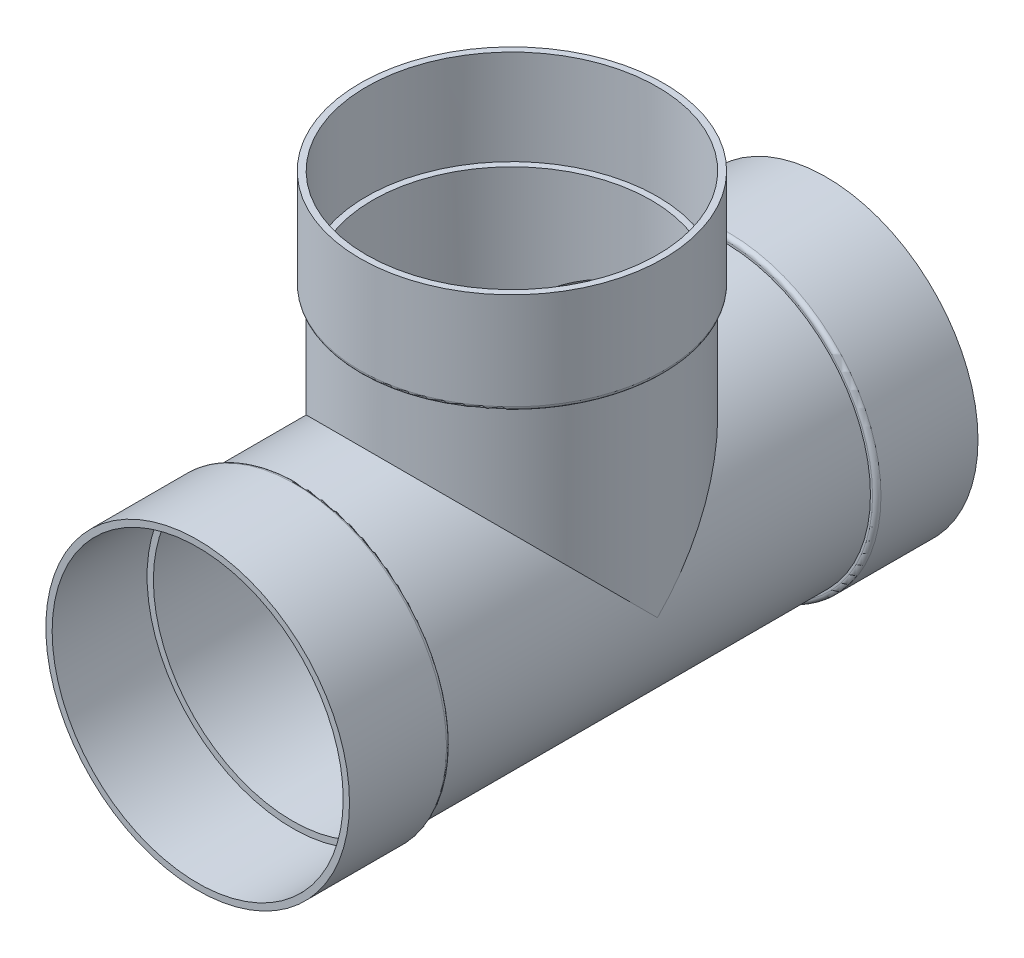
ISO-10303-21;
HEADER;
FILE_DESCRIPTION(('STEP AP214'),'2;1');
FILE_NAME('part.step','',(''),(''),'','','');
FILE_SCHEMA(('AUTOMOTIVE_DESIGN { 1 0 10303 214 1 1 1 1 }'));
ENDSEC;
DATA;
#1=APPLICATION_CONTEXT('core data for automotive mechanical design processes');
#2=APPLICATION_PROTOCOL_DEFINITION('international standard','automotive_design',2000,#1);
#3=PRODUCT_CONTEXT('',#1,'mechanical');
#4=PRODUCT('Part','Part','',(#3));
#5=PRODUCT_RELATED_PRODUCT_CATEGORY('part','',(#4));
#6=PRODUCT_DEFINITION_FORMATION('','',#4);
#7=PRODUCT_DEFINITION_CONTEXT('part definition',#1,'design');
#8=PRODUCT_DEFINITION('design','',#6,#7);
#9=PRODUCT_DEFINITION_SHAPE('','',#8);
#10=(LENGTH_UNIT() NAMED_UNIT(*) SI_UNIT(.MILLI.,.METRE.));
#11=(NAMED_UNIT(*) PLANE_ANGLE_UNIT() SI_UNIT($,.RADIAN.));
#12=(NAMED_UNIT(*) SI_UNIT($,.STERADIAN.) SOLID_ANGLE_UNIT());
#13=UNCERTAINTY_MEASURE_WITH_UNIT(LENGTH_MEASURE(1.E-05),#10,'distance_accuracy_value','');
#14=(GEOMETRIC_REPRESENTATION_CONTEXT(3) GLOBAL_UNCERTAINTY_ASSIGNED_CONTEXT((#13)) GLOBAL_UNIT_ASSIGNED_CONTEXT((#10,
#11,#12)) REPRESENTATION_CONTEXT('',''));
#15=CARTESIAN_POINT('',(0.,0.,0.));
#16=DIRECTION('',(0.,0.,1.));
#17=DIRECTION('',(1.,0.,0.));
#18=AXIS2_PLACEMENT_3D('',#15,#16,#17);
#19=CARTESIAN_POINT('',(0.,0.,236.5375));
#20=DIRECTION('',(0.,0.,-1.));
#21=DIRECTION('',(-1.,0.,0.));
#22=AXIS2_PLACEMENT_3D('',#19,#20,#21);
#23=PLANE('',#22);
#24=CARTESIAN_POINT('',(0.,0.,236.5375));
#25=DIRECTION('',(0.,0.,-1.));
#26=DIRECTION('',(-1.,0.,0.));
#27=AXIS2_PLACEMENT_3D('',#24,#25,#26);
#28=CIRCLE('',#27,109.5375);
#29=CARTESIAN_POINT('',(-109.5375,0.,236.5375));
#30=VERTEX_POINT('',#29);
#31=EDGE_CURVE('E86',#30,#30,#28,.F.);
#32=ORIENTED_EDGE('',*,*,#31,.F.);
#33=EDGE_LOOP('',(#32));
#34=FACE_BOUND('',#33,.T.);
#35=CARTESIAN_POINT('',(0.,0.,236.5375));
#36=DIRECTION('',(0.,0.,1.));
#37=DIRECTION('',(1.,0.,0.));
#38=AXIS2_PLACEMENT_3D('',#35,#36,#37);
#39=CIRCLE('',#38,114.2873);
#40=CARTESIAN_POINT('',(114.2873,0.,236.5375));
#41=VERTEX_POINT('',#40);
#42=EDGE_CURVE('E143',#41,#41,#39,.T.);
#43=ORIENTED_EDGE('',*,*,#42,.T.);
#44=EDGE_LOOP('',(#43));
#45=FACE_BOUND('',#44,.T.);
#46=ADVANCED_FACE('F53',(#34,#45),#23,.F.);
#47=CARTESIAN_POINT('',(0.,0.,168.70511138535));
#48=DIRECTION('',(0.,0.,1.));
#49=DIRECTION('',(1.,0.,0.));
#50=AXIS2_PLACEMENT_3D('',#47,#48,#49);
#51=CYLINDRICAL_SURFACE('',#50,114.2873);
#52=CARTESIAN_POINT('',(0.,0.,163.5125));
#53=DIRECTION('',(0.,0.,1.));
#54=DIRECTION('',(1.,0.,0.));
#55=AXIS2_PLACEMENT_3D('',#52,#53,#54);
#56=CIRCLE('',#55,114.2873);
#57=CARTESIAN_POINT('',(114.2873,0.,163.5125));
#58=VERTEX_POINT('',#57);
#59=EDGE_CURVE('E159',#58,#58,#56,.T.);
#60=ORIENTED_EDGE('',*,*,#59,.T.);
#61=EDGE_LOOP('',(#60));
#62=FACE_BOUND('',#61,.T.);
#63=ORIENTED_EDGE('',*,*,#42,.F.);
#64=EDGE_LOOP('',(#63));
#65=FACE_BOUND('',#64,.T.);
#66=ADVANCED_FACE('F184',(#62,#65),#51,.T.);
#67=CARTESIAN_POINT('',(0.,114.2873,160.3375));
#68=DIRECTION('',(0.,0.,1.));
#69=DIRECTION('',(1.,0.,0.));
#70=AXIS2_PLACEMENT_3D('',#67,#68,#69);
#71=PLANE('',#70);
#72=CARTESIAN_POINT('',(0.,0.,160.3375));
#73=DIRECTION('',(0.,0.,1.));
#74=DIRECTION('',(1.,0.,0.));
#75=AXIS2_PLACEMENT_3D('',#72,#73,#74);
#76=CIRCLE('',#75,111.1123);
#77=CARTESIAN_POINT('',(111.1123,0.,160.3375));
#78=VERTEX_POINT('',#77);
#79=EDGE_CURVE('E163',#78,#78,#76,.F.);
#80=ORIENTED_EDGE('',*,*,#79,.T.);
#81=EDGE_LOOP('',(#80));
#82=FACE_BOUND('',#81,.T.);
#83=CARTESIAN_POINT('',(0.,0.,160.3375));
#84=DIRECTION('',(0.,0.,1.));
#85=DIRECTION('',(1.,0.,0.));
#86=AXIS2_PLACEMENT_3D('',#83,#84,#85);
#87=CIRCLE('',#86,109.5375);
#88=CARTESIAN_POINT('',(109.5375,0.,160.3375));
#89=VERTEX_POINT('',#88);
#90=EDGE_CURVE('E139',#89,#89,#87,.T.);
#91=ORIENTED_EDGE('',*,*,#90,.T.);
#92=EDGE_LOOP('',(#91));
#93=FACE_BOUND('',#92,.T.);
#94=ADVANCED_FACE('F190',(#82,#93),#71,.F.);
#95=CARTESIAN_POINT('',(0.,0.,168.70511138535));
#96=DIRECTION('',(0.,0.,1.));
#97=DIRECTION('',(1.,0.,0.));
#98=AXIS2_PLACEMENT_3D('',#95,#96,#97);
#99=CYLINDRICAL_SURFACE('',#98,109.5375);
#100=CARTESIAN_POINT('',(0.,0.,0.));
#101=DIRECTION('',(0.,-0.707106781186547,0.707106781186547));
#102=DIRECTION('',(0.,0.707106781186547,0.707106781186547));
#103=AXIS2_PLACEMENT_3D('',#100,#101,#102);
#104=ELLIPSE('',#103,154.909418088443,109.5375);
#105=CARTESIAN_POINT('',(109.5375,0.,0.));
#106=VERTEX_POINT('',#105);
#107=CARTESIAN_POINT('',(-109.5375,0.,0.));
#108=VERTEX_POINT('',#107);
#109=EDGE_CURVE('E71',#106,#108,#104,.T.);
#110=ORIENTED_EDGE('',*,*,#109,.T.);
#111=CARTESIAN_POINT('',(0.,0.,0.));
#112=DIRECTION('',(0.,0.707106781186547,0.707106781186547));
#113=DIRECTION('',(0.,-0.707106781186547,0.707106781186547));
#114=AXIS2_PLACEMENT_3D('',#111,#112,#113);
#115=ELLIPSE('',#114,154.909418088443,109.5375);
#116=EDGE_CURVE('E68',#108,#106,#115,.F.);
#117=ORIENTED_EDGE('',*,*,#116,.T.);
#118=EDGE_LOOP('',(#110,#117));
#119=FACE_BOUND('',#118,.T.);
#120=ORIENTED_EDGE('',*,*,#90,.F.);
#121=EDGE_LOOP('',(#120));
#122=FACE_BOUND('',#121,.T.);
#123=CARTESIAN_POINT('',(0.,0.,-160.3375));
#124=DIRECTION('',(0.,0.,1.));
#125=DIRECTION('',(1.,0.,0.));
#126=AXIS2_PLACEMENT_3D('',#123,#124,#125);
#127=CIRCLE('',#126,109.5375);
#128=CARTESIAN_POINT('',(109.5375,0.,-160.3375));
#129=VERTEX_POINT('',#128);
#130=EDGE_CURVE('E135',#129,#129,#127,.T.);
#131=ORIENTED_EDGE('',*,*,#130,.T.);
#132=EDGE_LOOP('',(#131));
#133=FACE_BOUND('',#132,.T.);
#134=ADVANCED_FACE('F214',(#119,#122,#133),#99,.T.);
#135=CARTESIAN_POINT('',(0.,114.2873,-160.3375));
#136=DIRECTION('',(0.,0.,-1.));
#137=DIRECTION('',(-1.,0.,0.));
#138=AXIS2_PLACEMENT_3D('',#135,#136,#137);
#139=PLANE('',#138);
#140=CARTESIAN_POINT('',(0.,0.,-160.3375));
#141=DIRECTION('',(0.,0.,-1.));
#142=DIRECTION('',(-1.,0.,0.));
#143=AXIS2_PLACEMENT_3D('',#140,#141,#142);
#144=CIRCLE('',#143,111.1123);
#145=CARTESIAN_POINT('',(-111.1123,0.,-160.3375));
#146=VERTEX_POINT('',#145);
#147=EDGE_CURVE('E151',#146,#146,#144,.F.);
#148=ORIENTED_EDGE('',*,*,#147,.T.);
#149=EDGE_LOOP('',(#148));
#150=FACE_BOUND('',#149,.T.);
#151=ORIENTED_EDGE('',*,*,#130,.F.);
#152=EDGE_LOOP('',(#151));
#153=FACE_BOUND('',#152,.T.);
#154=ADVANCED_FACE('F210',(#150,#153),#139,.F.);
#155=CARTESIAN_POINT('',(0.,0.,168.70511138535));
#156=DIRECTION('',(0.,0.,1.));
#157=DIRECTION('',(1.,0.,0.));
#158=AXIS2_PLACEMENT_3D('',#155,#156,#157);
#159=CYLINDRICAL_SURFACE('',#158,114.2873);
#160=CARTESIAN_POINT('',(0.,0.,-163.5125));
#161=DIRECTION('',(0.,0.,-1.));
#162=DIRECTION('',(-1.,0.,0.));
#163=AXIS2_PLACEMENT_3D('',#160,#161,#162);
#164=CIRCLE('',#163,114.2873);
#165=CARTESIAN_POINT('',(-114.2873,0.,-163.5125));
#166=VERTEX_POINT('',#165);
#167=EDGE_CURVE('E155',#166,#166,#164,.T.);
#168=ORIENTED_EDGE('',*,*,#167,.T.);
#169=EDGE_LOOP('',(#168));
#170=FACE_BOUND('',#169,.T.);
#171=CARTESIAN_POINT('',(0.,0.,-236.5375));
#172=DIRECTION('',(0.,0.,1.));
#173=DIRECTION('',(1.,0.,0.));
#174=AXIS2_PLACEMENT_3D('',#171,#172,#173);
#175=CIRCLE('',#174,114.2873);
#176=CARTESIAN_POINT('',(114.2873,0.,-236.5375));
#177=VERTEX_POINT('',#176);
#178=EDGE_CURVE('E131',#177,#177,#175,.T.);
#179=ORIENTED_EDGE('',*,*,#178,.T.);
#180=EDGE_LOOP('',(#179));
#181=FACE_BOUND('',#180,.T.);
#182=ADVANCED_FACE('F213',(#170,#181),#159,.T.);
#183=CARTESIAN_POINT('',(0.,114.2873,-236.5375));
#184=DIRECTION('',(0.,0.,1.));
#185=DIRECTION('',(1.,0.,0.));
#186=AXIS2_PLACEMENT_3D('',#183,#184,#185);
#187=PLANE('',#186);
#188=CARTESIAN_POINT('',(0.,0.,-236.5375));
#189=DIRECTION('',(0.,0.,1.));
#190=DIRECTION('',(1.,0.,0.));
#191=AXIS2_PLACEMENT_3D('',#188,#189,#190);
#192=CIRCLE('',#191,109.5375);
#193=CARTESIAN_POINT('',(109.5375,0.,-236.5375));
#194=VERTEX_POINT('',#193);
#195=EDGE_CURVE('E108',#194,#194,#192,.T.);
#196=ORIENTED_EDGE('',*,*,#195,.T.);
#197=EDGE_LOOP('',(#196));
#198=FACE_BOUND('',#197,.T.);
#199=ORIENTED_EDGE('',*,*,#178,.F.);
#200=EDGE_LOOP('',(#199));
#201=FACE_BOUND('',#200,.T.);
#202=ADVANCED_FACE('F229',(#198,#201),#187,.F.);
#203=CARTESIAN_POINT('',(0.,0.,0.));
#204=DIRECTION('',(0.,1.,0.));
#205=DIRECTION('',(0.,0.,1.));
#206=AXIS2_PLACEMENT_3D('',#203,#204,#205);
#207=CYLINDRICAL_SURFACE('',#206,109.5375);
#208=CARTESIAN_POINT('',(0.,160.3375,0.));
#209=DIRECTION('',(0.,1.,0.));
#210=DIRECTION('',(0.,0.,1.));
#211=AXIS2_PLACEMENT_3D('',#208,#209,#210);
#212=CIRCLE('',#211,109.5375);
#213=CARTESIAN_POINT('',(0.,160.3375,109.5375));
#214=VERTEX_POINT('',#213);
#215=EDGE_CURVE('E90',#214,#214,#212,.T.);
#216=ORIENTED_EDGE('',*,*,#215,.F.);
#217=EDGE_LOOP('',(#216));
#218=FACE_BOUND('',#217,.T.);
#219=ORIENTED_EDGE('',*,*,#116,.F.);
#220=ORIENTED_EDGE('',*,*,#109,.F.);
#221=EDGE_LOOP('',(#219,#220));
#222=FACE_BOUND('',#221,.T.);
#223=ADVANCED_FACE('F233',(#218,#222),#207,.T.);
#224=CARTESIAN_POINT('',(0.,236.5375,0.));
#225=DIRECTION('',(0.,1.,0.));
#226=DIRECTION('',(0.,0.,1.));
#227=AXIS2_PLACEMENT_3D('',#224,#225,#226);
#228=PLANE('',#227);
#229=CARTESIAN_POINT('',(0.,236.5375,0.));
#230=DIRECTION('',(0.,1.,0.));
#231=DIRECTION('',(0.,0.,1.));
#232=AXIS2_PLACEMENT_3D('',#229,#230,#231);
#233=CIRCLE('',#232,109.5375);
#234=CARTESIAN_POINT('',(0.,236.5375,109.5375));
#235=VERTEX_POINT('',#234);
#236=EDGE_CURVE('E117',#235,#235,#233,.T.);
#237=ORIENTED_EDGE('',*,*,#236,.F.);
#238=EDGE_LOOP('',(#237));
#239=FACE_BOUND('',#238,.T.);
#240=CARTESIAN_POINT('',(0.,236.5375,0.));
#241=DIRECTION('',(0.,1.,0.));
#242=DIRECTION('',(0.,0.,1.));
#243=AXIS2_PLACEMENT_3D('',#240,#241,#242);
#244=CIRCLE('',#243,114.2873);
#245=CARTESIAN_POINT('',(0.,236.5375,114.2873));
#246=VERTEX_POINT('',#245);
#247=EDGE_CURVE('E95',#246,#246,#244,.T.);
#248=ORIENTED_EDGE('',*,*,#247,.T.);
#249=EDGE_LOOP('',(#248));
#250=FACE_BOUND('',#249,.T.);
#251=ADVANCED_FACE('F235',(#239,#250),#228,.T.);
#252=CARTESIAN_POINT('',(0.,0.,0.));
#253=DIRECTION('',(0.,1.,0.));
#254=DIRECTION('',(0.,0.,1.));
#255=AXIS2_PLACEMENT_3D('',#252,#253,#254);
#256=CYLINDRICAL_SURFACE('',#255,114.2873);
#257=CARTESIAN_POINT('',(0.,163.5125,0.));
#258=DIRECTION('',(0.,-1.,0.));
#259=DIRECTION('',(0.,0.,-1.));
#260=AXIS2_PLACEMENT_3D('',#257,#258,#259);
#261=CIRCLE('',#260,114.2873);
#262=CARTESIAN_POINT('',(0.,163.5125,-114.2873));
#263=VERTEX_POINT('',#262);
#264=EDGE_CURVE('E62',#263,#263,#261,.F.);
#265=ORIENTED_EDGE('',*,*,#264,.T.);
#266=EDGE_LOOP('',(#265));
#267=FACE_BOUND('',#266,.T.);
#268=ORIENTED_EDGE('',*,*,#247,.F.);
#269=EDGE_LOOP('',(#268));
#270=FACE_BOUND('',#269,.T.);
#271=ADVANCED_FACE('F171',(#267,#270),#256,.T.);
#272=CARTESIAN_POINT('',(0.,160.3375,114.2873));
#273=DIRECTION('',(0.,-1.,0.));
#274=DIRECTION('',(0.,0.,-1.));
#275=AXIS2_PLACEMENT_3D('',#272,#273,#274);
#276=PLANE('',#275);
#277=CARTESIAN_POINT('',(0.,160.3375,0.));
#278=DIRECTION('',(0.,-1.,0.));
#279=DIRECTION('',(0.,0.,-1.));
#280=AXIS2_PLACEMENT_3D('',#277,#278,#279);
#281=CIRCLE('',#280,111.1123);
#282=CARTESIAN_POINT('',(0.,160.3375,-111.1123));
#283=VERTEX_POINT('',#282);
#284=EDGE_CURVE('E13',#283,#283,#281,.T.);
#285=ORIENTED_EDGE('',*,*,#284,.T.);
#286=EDGE_LOOP('',(#285));
#287=FACE_BOUND('',#286,.T.);
#288=ORIENTED_EDGE('',*,*,#215,.T.);
#289=EDGE_LOOP('',(#288));
#290=FACE_BOUND('',#289,.T.);
#291=ADVANCED_FACE('F241',(#287,#290),#276,.T.);
#292=CARTESIAN_POINT('',(0.,0.,168.70511138535));
#293=DIRECTION('',(0.,0.,1.));
#294=DIRECTION('',(1.,0.,0.));
#295=AXIS2_PLACEMENT_3D('',#292,#293,#294);
#296=CYLINDRICAL_SURFACE('',#295,109.5375);
#297=ORIENTED_EDGE('',*,*,#31,.T.);
#298=EDGE_LOOP('',(#297));
#299=FACE_BOUND('',#298,.T.);
#300=CARTESIAN_POINT('',(0.,0.,165.0873));
#301=DIRECTION('',(0.,0.,1.));
#302=DIRECTION('',(1.,0.,0.));
#303=AXIS2_PLACEMENT_3D('',#300,#301,#302);
#304=CIRCLE('',#303,109.5375);
#305=CARTESIAN_POINT('',(109.5375,0.,165.0873));
#306=VERTEX_POINT('',#305);
#307=EDGE_CURVE('E121',#306,#306,#304,.T.);
#308=ORIENTED_EDGE('',*,*,#307,.F.);
#309=EDGE_LOOP('',(#308));
#310=FACE_BOUND('',#309,.T.);
#311=ADVANCED_FACE('F244',(#299,#310),#296,.F.);
#312=CARTESIAN_POINT('',(0.,114.2873,165.0873));
#313=DIRECTION('',(0.,0.,1.));
#314=DIRECTION('',(1.,0.,0.));
#315=AXIS2_PLACEMENT_3D('',#312,#313,#314);
#316=PLANE('',#315);
#317=ORIENTED_EDGE('',*,*,#307,.T.);
#318=EDGE_LOOP('',(#317));
#319=FACE_BOUND('',#318,.T.);
#320=CARTESIAN_POINT('',(0.,0.,165.0873));
#321=DIRECTION('',(0.,0.,1.));
#322=DIRECTION('',(1.,0.,0.));
#323=AXIS2_PLACEMENT_3D('',#320,#321,#322);
#324=CIRCLE('',#323,104.7877);
#325=CARTESIAN_POINT('',(104.7877,0.,165.0873));
#326=VERTEX_POINT('',#325);
#327=EDGE_CURVE('E103',#326,#326,#324,.T.);
#328=ORIENTED_EDGE('',*,*,#327,.F.);
#329=EDGE_LOOP('',(#328));
#330=FACE_BOUND('',#329,.T.);
#331=ADVANCED_FACE('F265',(#319,#330),#316,.T.);
#332=CARTESIAN_POINT('',(0.,0.,168.70511138535));
#333=DIRECTION('',(0.,0.,1.));
#334=DIRECTION('',(1.,0.,0.));
#335=AXIS2_PLACEMENT_3D('',#332,#333,#334);
#336=CYLINDRICAL_SURFACE('',#335,104.7877);
#337=CARTESIAN_POINT('',(0.,0.,0.));
#338=DIRECTION('',(0.,-0.707106781186547,0.707106781186547));
#339=DIRECTION('',(0.,0.707106781186547,0.707106781186547));
#340=AXIS2_PLACEMENT_3D('',#337,#338,#339);
#341=ELLIPSE('',#340,148.192186509883,104.7877);
#342=CARTESIAN_POINT('',(104.7877,0.,0.));
#343=VERTEX_POINT('',#342);
#344=CARTESIAN_POINT('',(-104.7877,0.,0.));
#345=VERTEX_POINT('',#344);
#346=EDGE_CURVE('E79',#343,#345,#341,.T.);
#347=ORIENTED_EDGE('',*,*,#346,.F.);
#348=CARTESIAN_POINT('',(0.,0.,0.));
#349=DIRECTION('',(0.,0.707106781186547,0.707106781186547));
#350=DIRECTION('',(0.,-0.707106781186547,0.707106781186547));
#351=AXIS2_PLACEMENT_3D('',#348,#349,#350);
#352=ELLIPSE('',#351,148.192186509883,104.7877);
#353=EDGE_CURVE('E83',#345,#343,#352,.F.);
#354=ORIENTED_EDGE('',*,*,#353,.F.);
#355=EDGE_LOOP('',(#347,#354));
#356=FACE_BOUND('',#355,.T.);
#357=ORIENTED_EDGE('',*,*,#327,.T.);
#358=EDGE_LOOP('',(#357));
#359=FACE_BOUND('',#358,.T.);
#360=CARTESIAN_POINT('',(0.,0.,-165.0873));
#361=DIRECTION('',(0.,0.,-1.));
#362=DIRECTION('',(-1.,0.,0.));
#363=AXIS2_PLACEMENT_3D('',#360,#361,#362);
#364=CIRCLE('',#363,104.7877);
#365=CARTESIAN_POINT('',(-104.7877,0.,-165.0873));
#366=VERTEX_POINT('',#365);
#367=EDGE_CURVE('E99',#366,#366,#364,.F.);
#368=ORIENTED_EDGE('',*,*,#367,.F.);
#369=EDGE_LOOP('',(#368));
#370=FACE_BOUND('',#369,.T.);
#371=ADVANCED_FACE('F81',(#356,#359,#370),#336,.F.);
#372=CARTESIAN_POINT('',(0.,114.2873,-165.0873));
#373=DIRECTION('',(0.,0.,-1.));
#374=DIRECTION('',(-1.,0.,0.));
#375=AXIS2_PLACEMENT_3D('',#372,#373,#374);
#376=PLANE('',#375);
#377=ORIENTED_EDGE('',*,*,#367,.T.);
#378=EDGE_LOOP('',(#377));
#379=FACE_BOUND('',#378,.T.);
#380=CARTESIAN_POINT('',(0.,0.,-165.0873));
#381=DIRECTION('',(0.,0.,-1.));
#382=DIRECTION('',(-1.,0.,0.));
#383=AXIS2_PLACEMENT_3D('',#380,#381,#382);
#384=CIRCLE('',#383,109.5375);
#385=CARTESIAN_POINT('',(-109.5375,0.,-165.0873));
#386=VERTEX_POINT('',#385);
#387=EDGE_CURVE('E104',#386,#386,#384,.F.);
#388=ORIENTED_EDGE('',*,*,#387,.F.);
#389=EDGE_LOOP('',(#388));
#390=FACE_BOUND('',#389,.T.);
#391=ADVANCED_FACE('F258',(#379,#390),#376,.T.);
#392=CARTESIAN_POINT('',(0.,0.,168.70511138535));
#393=DIRECTION('',(0.,0.,1.));
#394=DIRECTION('',(1.,0.,0.));
#395=AXIS2_PLACEMENT_3D('',#392,#393,#394);
#396=CYLINDRICAL_SURFACE('',#395,109.5375);
#397=ORIENTED_EDGE('',*,*,#387,.T.);
#398=EDGE_LOOP('',(#397));
#399=FACE_BOUND('',#398,.T.);
#400=ORIENTED_EDGE('',*,*,#195,.F.);
#401=EDGE_LOOP('',(#400));
#402=FACE_BOUND('',#401,.T.);
#403=ADVANCED_FACE('F254',(#399,#402),#396,.F.);
#404=CARTESIAN_POINT('',(0.,0.,0.));
#405=DIRECTION('',(0.,1.,0.));
#406=DIRECTION('',(0.,0.,1.));
#407=AXIS2_PLACEMENT_3D('',#404,#405,#406);
#408=CYLINDRICAL_SURFACE('',#407,104.7877);
#409=CARTESIAN_POINT('',(0.,165.0873,0.));
#410=DIRECTION('',(0.,-1.,0.));
#411=DIRECTION('',(0.,0.,-1.));
#412=AXIS2_PLACEMENT_3D('',#409,#410,#411);
#413=CIRCLE('',#412,104.7877);
#414=CARTESIAN_POINT('',(0.,165.0873,-104.7877));
#415=VERTEX_POINT('',#414);
#416=EDGE_CURVE('E109',#415,#415,#413,.F.);
#417=ORIENTED_EDGE('',*,*,#416,.T.);
#418=EDGE_LOOP('',(#417));
#419=FACE_BOUND('',#418,.T.);
#420=ORIENTED_EDGE('',*,*,#353,.T.);
#421=ORIENTED_EDGE('',*,*,#346,.T.);
#422=EDGE_LOOP('',(#420,#421));
#423=FACE_BOUND('',#422,.T.);
#424=ADVANCED_FACE('F88',(#419,#423),#408,.F.);
#425=CARTESIAN_POINT('',(0.,0.,0.));
#426=DIRECTION('',(0.,1.,0.));
#427=DIRECTION('',(0.,0.,1.));
#428=AXIS2_PLACEMENT_3D('',#425,#426,#427);
#429=CYLINDRICAL_SURFACE('',#428,109.5375);
#430=CARTESIAN_POINT('',(0.,165.0873,0.));
#431=DIRECTION('',(0.,-1.,0.));
#432=DIRECTION('',(0.,0.,-1.));
#433=AXIS2_PLACEMENT_3D('',#430,#431,#432);
#434=CIRCLE('',#433,109.5375);
#435=CARTESIAN_POINT('',(0.,165.0873,-109.5375));
#436=VERTEX_POINT('',#435);
#437=EDGE_CURVE('E113',#436,#436,#434,.F.);
#438=ORIENTED_EDGE('',*,*,#437,.F.);
#439=EDGE_LOOP('',(#438));
#440=FACE_BOUND('',#439,.T.);
#441=ORIENTED_EDGE('',*,*,#236,.T.);
#442=EDGE_LOOP('',(#441));
#443=FACE_BOUND('',#442,.T.);
#444=ADVANCED_FACE('F203',(#440,#443),#429,.F.);
#445=CARTESIAN_POINT('',(0.,165.0873,114.2873));
#446=DIRECTION('',(0.,-1.,0.));
#447=DIRECTION('',(0.,0.,-1.));
#448=AXIS2_PLACEMENT_3D('',#445,#446,#447);
#449=PLANE('',#448);
#450=ORIENTED_EDGE('',*,*,#416,.F.);
#451=EDGE_LOOP('',(#450));
#452=FACE_BOUND('',#451,.T.);
#453=ORIENTED_EDGE('',*,*,#437,.T.);
#454=EDGE_LOOP('',(#453));
#455=FACE_BOUND('',#454,.T.);
#456=ADVANCED_FACE('F198',(#452,#455),#449,.F.);
#457=CARTESIAN_POINT('',(0.,0.,-163.5125));
#458=DIRECTION('',(0.,0.,-1.));
#459=DIRECTION('',(-1.,0.,0.));
#460=AXIS2_PLACEMENT_3D('',#457,#458,#459);
#461=TOROIDAL_SURFACE('',#460,111.1123,3.175);
#462=ORIENTED_EDGE('',*,*,#167,.F.);
#463=EDGE_LOOP('',(#462));
#464=FACE_BOUND('',#463,.T.);
#465=ORIENTED_EDGE('',*,*,#147,.F.);
#466=EDGE_LOOP('',(#465));
#467=FACE_BOUND('',#466,.T.);
#468=ADVANCED_FACE('F180',(#464,#467),#461,.T.);
#469=CARTESIAN_POINT('',(0.,0.,163.5125));
#470=DIRECTION('',(0.,0.,1.));
#471=DIRECTION('',(1.,0.,0.));
#472=AXIS2_PLACEMENT_3D('',#469,#470,#471);
#473=TOROIDAL_SURFACE('',#472,111.1123,3.175);
#474=ORIENTED_EDGE('',*,*,#79,.F.);
#475=EDGE_LOOP('',(#474));
#476=FACE_BOUND('',#475,.T.);
#477=ORIENTED_EDGE('',*,*,#59,.F.);
#478=EDGE_LOOP('',(#477));
#479=FACE_BOUND('',#478,.T.);
#480=ADVANCED_FACE('F175',(#476,#479),#473,.T.);
#481=CARTESIAN_POINT('',(0.,163.5125,0.));
#482=DIRECTION('',(0.,-1.,0.));
#483=DIRECTION('',(0.,0.,-1.));
#484=AXIS2_PLACEMENT_3D('',#481,#482,#483);
#485=TOROIDAL_SURFACE('',#484,111.1123,3.175);
#486=ORIENTED_EDGE('',*,*,#284,.F.);
#487=EDGE_LOOP('',(#486));
#488=FACE_BOUND('',#487,.T.);
#489=ORIENTED_EDGE('',*,*,#264,.F.);
#490=EDGE_LOOP('',(#489));
#491=FACE_BOUND('',#490,.T.);
#492=ADVANCED_FACE('F55',(#488,#491),#485,.T.);
#493=CLOSED_SHELL('',(#46,#66,#94,#134,#154,#182,#202,#223,#251,#271,#291,#311,#331,#371,#391,
#403,#424,#444,#456,#468,#480,#492));
#494=MANIFOLD_SOLID_BREP('B2',#493);
#495=ADVANCED_BREP_SHAPE_REPRESENTATION('',(#18,#494),#14);
#496=SHAPE_DEFINITION_REPRESENTATION(#9,#495);
ENDSEC;
END-ISO-10303-21;
